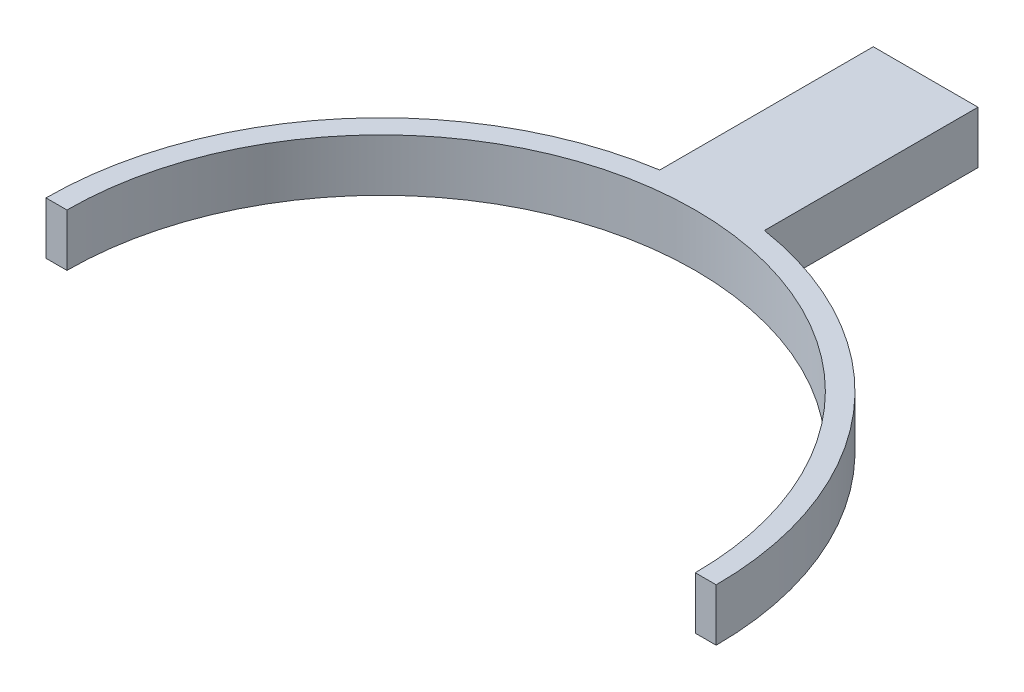
ISO-10303-21;
HEADER;
FILE_DESCRIPTION(('STEP AP214'),'2;1');
FILE_NAME('part.step','',(''),(''),'','','');
FILE_SCHEMA(('AUTOMOTIVE_DESIGN { 1 0 10303 214 1 1 1 1 }'));
ENDSEC;
DATA;
#1=APPLICATION_CONTEXT('core data for automotive mechanical design processes');
#2=APPLICATION_PROTOCOL_DEFINITION('international standard','automotive_design',2000,#1);
#3=PRODUCT_CONTEXT('',#1,'mechanical');
#4=PRODUCT('Part','Part','',(#3));
#5=PRODUCT_RELATED_PRODUCT_CATEGORY('part','',(#4));
#6=PRODUCT_DEFINITION_FORMATION('','',#4);
#7=PRODUCT_DEFINITION_CONTEXT('part definition',#1,'design');
#8=PRODUCT_DEFINITION('design','',#6,#7);
#9=PRODUCT_DEFINITION_SHAPE('','',#8);
#10=(LENGTH_UNIT() NAMED_UNIT(*) SI_UNIT(.MILLI.,.METRE.));
#11=(NAMED_UNIT(*) PLANE_ANGLE_UNIT() SI_UNIT($,.RADIAN.));
#12=(NAMED_UNIT(*) SI_UNIT($,.STERADIAN.) SOLID_ANGLE_UNIT());
#13=UNCERTAINTY_MEASURE_WITH_UNIT(LENGTH_MEASURE(1.E-05),#10,'distance_accuracy_value','');
#14=(GEOMETRIC_REPRESENTATION_CONTEXT(3) GLOBAL_UNCERTAINTY_ASSIGNED_CONTEXT((#13)) GLOBAL_UNIT_ASSIGNED_CONTEXT((#10,
#11,#12)) REPRESENTATION_CONTEXT('',''));
#15=CARTESIAN_POINT('',(0.,0.,0.));
#16=DIRECTION('',(0.,0.,1.));
#17=DIRECTION('',(1.,0.,0.));
#18=AXIS2_PLACEMENT_3D('',#15,#16,#17);
#19=CARTESIAN_POINT('',(0.,5.,0.));
#20=DIRECTION('',(0.,-1.,0.));
#21=DIRECTION('',(0.,0.,-1.));
#22=AXIS2_PLACEMENT_3D('',#19,#20,#21);
#23=CYLINDRICAL_SURFACE('',#22,32.);
#24=CARTESIAN_POINT('',(0.,0.,0.));
#25=DIRECTION('',(0.,1.,0.));
#26=DIRECTION('',(0.,0.,1.));
#27=AXIS2_PLACEMENT_3D('',#24,#25,#26);
#28=CIRCLE('',#27,32.);
#29=CARTESIAN_POINT('',(32.,0.,0.));
#30=VERTEX_POINT('',#29);
#31=CARTESIAN_POINT('',(5.,0.,-31.6069612585582));
#32=VERTEX_POINT('',#31);
#33=EDGE_CURVE('E148',#30,#32,#28,.T.);
#34=ORIENTED_EDGE('',*,*,#33,.T.);
#35=DIRECTION('',(0.,-1.,0.));
#36=VECTOR('',#35,1.);
#37=CARTESIAN_POINT('',(5.,5.,-31.6069612585582));
#38=LINE('',#37,#36);
#39=CARTESIAN_POINT('',(5.,5.,-31.6069612585582));
#40=VERTEX_POINT('',#39);
#41=EDGE_CURVE('E60',#32,#40,#38,.F.);
#42=ORIENTED_EDGE('',*,*,#41,.T.);
#43=CARTESIAN_POINT('',(0.,5.,0.));
#44=DIRECTION('',(0.,1.,0.));
#45=DIRECTION('',(0.,0.,1.));
#46=AXIS2_PLACEMENT_3D('',#43,#44,#45);
#47=CIRCLE('',#46,32.);
#48=CARTESIAN_POINT('',(32.,5.,0.));
#49=VERTEX_POINT('',#48);
#50=EDGE_CURVE('E122',#49,#40,#47,.T.);
#51=ORIENTED_EDGE('',*,*,#50,.F.);
#52=DIRECTION('',(0.,-1.,0.));
#53=VECTOR('',#52,1.);
#54=CARTESIAN_POINT('',(32.,5.,0.));
#55=LINE('',#54,#53);
#56=EDGE_CURVE('E147',#49,#30,#55,.T.);
#57=ORIENTED_EDGE('',*,*,#56,.T.);
#58=EDGE_LOOP('',(#34,#42,#51,#57));
#59=FACE_BOUND('',#58,.T.);
#60=ADVANCED_FACE('F37',(#59),#23,.T.);
#61=CARTESIAN_POINT('',(-5.,5.,-31.6069612585582));
#62=VERTEX_POINT('',#61);
#63=CARTESIAN_POINT('',(-32.,5.,0.));
#64=VERTEX_POINT('',#63);
#65=EDGE_CURVE('E52',#62,#64,#47,.T.);
#66=ORIENTED_EDGE('',*,*,#65,.F.);
#67=DIRECTION('',(0.,-1.,0.));
#68=VECTOR('',#67,1.);
#69=CARTESIAN_POINT('',(-5.,5.,-31.6069612585582));
#70=LINE('',#69,#68);
#71=CARTESIAN_POINT('',(-5.,0.,-31.6069612585582));
#72=VERTEX_POINT('',#71);
#73=EDGE_CURVE('E114',#62,#72,#70,.T.);
#74=ORIENTED_EDGE('',*,*,#73,.T.);
#75=CARTESIAN_POINT('',(-32.,0.,0.));
#76=VERTEX_POINT('',#75);
#77=EDGE_CURVE('E139',#72,#76,#28,.T.);
#78=ORIENTED_EDGE('',*,*,#77,.T.);
#79=DIRECTION('',(0.,-1.,0.));
#80=VECTOR('',#79,1.);
#81=CARTESIAN_POINT('',(-32.,5.,0.));
#82=LINE('',#81,#80);
#83=EDGE_CURVE('E11',#64,#76,#82,.T.);
#84=ORIENTED_EDGE('',*,*,#83,.F.);
#85=EDGE_LOOP('',(#66,#74,#78,#84));
#86=FACE_BOUND('',#85,.T.);
#87=ADVANCED_FACE('F39',(#86),#23,.T.);
#88=CARTESIAN_POINT('',(-32.,5.,0.));
#89=DIRECTION('',(0.,0.,-1.));
#90=DIRECTION('',(-1.,0.,0.));
#91=AXIS2_PLACEMENT_3D('',#88,#89,#90);
#92=PLANE('',#91);
#93=DIRECTION('',(1.,0.,0.));
#94=VECTOR('',#93,1.);
#95=CARTESIAN_POINT('',(-32.,0.,0.));
#96=LINE('',#95,#94);
#97=CARTESIAN_POINT('',(-30.,0.,0.));
#98=VERTEX_POINT('',#97);
#99=EDGE_CURVE('E150',#76,#98,#96,.T.);
#100=ORIENTED_EDGE('',*,*,#99,.T.);
#101=DIRECTION('',(0.,-1.,0.));
#102=VECTOR('',#101,1.);
#103=CARTESIAN_POINT('',(-30.,5.,0.));
#104=LINE('',#103,#102);
#105=CARTESIAN_POINT('',(-30.,5.,0.));
#106=VERTEX_POINT('',#105);
#107=EDGE_CURVE('E45',#106,#98,#104,.T.);
#108=ORIENTED_EDGE('',*,*,#107,.F.);
#109=DIRECTION('',(1.,0.,0.));
#110=VECTOR('',#109,1.);
#111=CARTESIAN_POINT('',(-32.,5.,0.));
#112=LINE('',#111,#110);
#113=EDGE_CURVE('E141',#64,#106,#112,.T.);
#114=ORIENTED_EDGE('',*,*,#113,.F.);
#115=ORIENTED_EDGE('',*,*,#83,.T.);
#116=EDGE_LOOP('',(#100,#108,#114,#115));
#117=FACE_BOUND('',#116,.T.);
#118=ADVANCED_FACE('F181',(#117),#92,.F.);
#119=CARTESIAN_POINT('',(0.,5.,0.));
#120=DIRECTION('',(0.,-1.,0.));
#121=DIRECTION('',(0.,0.,-1.));
#122=AXIS2_PLACEMENT_3D('',#119,#120,#121);
#123=CYLINDRICAL_SURFACE('',#122,30.);
#124=CARTESIAN_POINT('',(0.,0.,0.));
#125=DIRECTION('',(0.,-1.,0.));
#126=DIRECTION('',(0.,0.,1.));
#127=AXIS2_PLACEMENT_3D('',#124,#125,#126);
#128=CIRCLE('',#127,30.);
#129=CARTESIAN_POINT('',(30.,0.,0.));
#130=VERTEX_POINT('',#129);
#131=EDGE_CURVE('E152',#98,#130,#128,.T.);
#132=ORIENTED_EDGE('',*,*,#131,.T.);
#133=DIRECTION('',(0.,-1.,0.));
#134=VECTOR('',#133,1.);
#135=CARTESIAN_POINT('',(30.,5.,0.));
#136=LINE('',#135,#134);
#137=CARTESIAN_POINT('',(30.,5.,0.));
#138=VERTEX_POINT('',#137);
#139=EDGE_CURVE('E158',#138,#130,#136,.T.);
#140=ORIENTED_EDGE('',*,*,#139,.F.);
#141=CARTESIAN_POINT('',(0.,5.,0.));
#142=DIRECTION('',(0.,-1.,0.));
#143=DIRECTION('',(0.,0.,1.));
#144=AXIS2_PLACEMENT_3D('',#141,#142,#143);
#145=CIRCLE('',#144,30.);
#146=EDGE_CURVE('E143',#106,#138,#145,.T.);
#147=ORIENTED_EDGE('',*,*,#146,.F.);
#148=ORIENTED_EDGE('',*,*,#107,.T.);
#149=EDGE_LOOP('',(#132,#140,#147,#148));
#150=FACE_BOUND('',#149,.T.);
#151=ADVANCED_FACE('F165',(#150),#123,.F.);
#152=CARTESIAN_POINT('',(30.,5.,0.));
#153=DIRECTION('',(0.,0.,-1.));
#154=DIRECTION('',(-1.,0.,0.));
#155=AXIS2_PLACEMENT_3D('',#152,#153,#154);
#156=PLANE('',#155);
#157=DIRECTION('',(1.,0.,0.));
#158=VECTOR('',#157,1.);
#159=CARTESIAN_POINT('',(30.,0.,0.));
#160=LINE('',#159,#158);
#161=EDGE_CURVE('E154',#130,#30,#160,.T.);
#162=ORIENTED_EDGE('',*,*,#161,.T.);
#163=ORIENTED_EDGE('',*,*,#56,.F.);
#164=DIRECTION('',(1.,0.,0.));
#165=VECTOR('',#164,1.);
#166=CARTESIAN_POINT('',(30.,5.,0.));
#167=LINE('',#166,#165);
#168=EDGE_CURVE('E145',#138,#49,#167,.T.);
#169=ORIENTED_EDGE('',*,*,#168,.F.);
#170=ORIENTED_EDGE('',*,*,#139,.T.);
#171=EDGE_LOOP('',(#162,#163,#169,#170));
#172=FACE_BOUND('',#171,.T.);
#173=ADVANCED_FACE('F176',(#172),#156,.F.);
#174=CARTESIAN_POINT('',(0.,5.,0.));
#175=DIRECTION('',(0.,1.,0.));
#176=DIRECTION('',(0.,0.,1.));
#177=AXIS2_PLACEMENT_3D('',#174,#175,#176);
#178=PLANE('',#177);
#179=ORIENTED_EDGE('',*,*,#50,.T.);
#180=DIRECTION('',(0.,0.,1.));
#181=VECTOR('',#180,1.);
#182=CARTESIAN_POINT('',(5.,5.,0.));
#183=LINE('',#182,#181);
#184=CARTESIAN_POINT('',(5.,5.,-52.));
#185=VERTEX_POINT('',#184);
#186=EDGE_CURVE('E107',#185,#40,#183,.T.);
#187=ORIENTED_EDGE('',*,*,#186,.F.);
#188=DIRECTION('',(1.,0.,0.));
#189=VECTOR('',#188,1.);
#190=CARTESIAN_POINT('',(0.,5.,-52.));
#191=LINE('',#190,#189);
#192=CARTESIAN_POINT('',(-5.,5.,-52.));
#193=VERTEX_POINT('',#192);
#194=EDGE_CURVE('E121',#193,#185,#191,.T.);
#195=ORIENTED_EDGE('',*,*,#194,.F.);
#196=DIRECTION('',(0.,0.,-1.));
#197=VECTOR('',#196,1.);
#198=CARTESIAN_POINT('',(-5.,5.,0.));
#199=LINE('',#198,#197);
#200=EDGE_CURVE('E128',#62,#193,#199,.T.);
#201=ORIENTED_EDGE('',*,*,#200,.F.);
#202=ORIENTED_EDGE('',*,*,#65,.T.);
#203=ORIENTED_EDGE('',*,*,#113,.T.);
#204=ORIENTED_EDGE('',*,*,#146,.T.);
#205=ORIENTED_EDGE('',*,*,#168,.T.);
#206=EDGE_LOOP('',(#179,#187,#195,#201,#202,#203,#204,#205));
#207=FACE_BOUND('',#206,.T.);
#208=ADVANCED_FACE('F119',(#207),#178,.T.);
#209=CARTESIAN_POINT('',(0.,0.,0.));
#210=DIRECTION('',(0.,1.,0.));
#211=DIRECTION('',(0.,0.,1.));
#212=AXIS2_PLACEMENT_3D('',#209,#210,#211);
#213=PLANE('',#212);
#214=ORIENTED_EDGE('',*,*,#77,.F.);
#215=DIRECTION('',(0.,0.,-1.));
#216=VECTOR('',#215,1.);
#217=CARTESIAN_POINT('',(-5.,0.,0.));
#218=LINE('',#217,#216);
#219=CARTESIAN_POINT('',(-5.,0.,-52.));
#220=VERTEX_POINT('',#219);
#221=EDGE_CURVE('E123',#72,#220,#218,.T.);
#222=ORIENTED_EDGE('',*,*,#221,.T.);
#223=DIRECTION('',(1.,0.,0.));
#224=VECTOR('',#223,1.);
#225=CARTESIAN_POINT('',(0.,0.,-52.));
#226=LINE('',#225,#224);
#227=CARTESIAN_POINT('',(5.,0.,-52.));
#228=VERTEX_POINT('',#227);
#229=EDGE_CURVE('E133',#220,#228,#226,.T.);
#230=ORIENTED_EDGE('',*,*,#229,.T.);
#231=DIRECTION('',(0.,0.,1.));
#232=VECTOR('',#231,1.);
#233=CARTESIAN_POINT('',(5.,0.,0.));
#234=LINE('',#233,#232);
#235=EDGE_CURVE('E109',#228,#32,#234,.T.);
#236=ORIENTED_EDGE('',*,*,#235,.T.);
#237=ORIENTED_EDGE('',*,*,#33,.F.);
#238=ORIENTED_EDGE('',*,*,#161,.F.);
#239=ORIENTED_EDGE('',*,*,#131,.F.);
#240=ORIENTED_EDGE('',*,*,#99,.F.);
#241=EDGE_LOOP('',(#214,#222,#230,#236,#237,#238,#239,#240));
#242=FACE_BOUND('',#241,.T.);
#243=ADVANCED_FACE('F172',(#242),#213,.F.);
#244=CARTESIAN_POINT('',(5.,5.,0.));
#245=DIRECTION('',(1.,0.,0.));
#246=DIRECTION('',(0.,0.,-1.));
#247=AXIS2_PLACEMENT_3D('',#244,#245,#246);
#248=PLANE('',#247);
#249=ORIENTED_EDGE('',*,*,#41,.F.);
#250=ORIENTED_EDGE('',*,*,#235,.F.);
#251=DIRECTION('',(0.,-1.,0.));
#252=VECTOR('',#251,1.);
#253=CARTESIAN_POINT('',(5.,5.,-52.));
#254=LINE('',#253,#252);
#255=EDGE_CURVE('E104',#185,#228,#254,.T.);
#256=ORIENTED_EDGE('',*,*,#255,.F.);
#257=ORIENTED_EDGE('',*,*,#186,.T.);
#258=EDGE_LOOP('',(#249,#250,#256,#257));
#259=FACE_BOUND('',#258,.T.);
#260=ADVANCED_FACE('F106',(#259),#248,.T.);
#261=CARTESIAN_POINT('',(-5.,5.,0.));
#262=DIRECTION('',(-1.,0.,0.));
#263=DIRECTION('',(0.,0.,1.));
#264=AXIS2_PLACEMENT_3D('',#261,#262,#263);
#265=PLANE('',#264);
#266=ORIENTED_EDGE('',*,*,#73,.F.);
#267=ORIENTED_EDGE('',*,*,#200,.T.);
#268=DIRECTION('',(0.,-1.,0.));
#269=VECTOR('',#268,1.);
#270=CARTESIAN_POINT('',(-5.,5.,-52.));
#271=LINE('',#270,#269);
#272=EDGE_CURVE('E115',#193,#220,#271,.T.);
#273=ORIENTED_EDGE('',*,*,#272,.T.);
#274=ORIENTED_EDGE('',*,*,#221,.F.);
#275=EDGE_LOOP('',(#266,#267,#273,#274));
#276=FACE_BOUND('',#275,.T.);
#277=ADVANCED_FACE('F180',(#276),#265,.T.);
#278=CARTESIAN_POINT('',(0.,5.,-52.));
#279=DIRECTION('',(0.,0.,-1.));
#280=DIRECTION('',(-1.,0.,0.));
#281=AXIS2_PLACEMENT_3D('',#278,#279,#280);
#282=PLANE('',#281);
#283=ORIENTED_EDGE('',*,*,#229,.F.);
#284=ORIENTED_EDGE('',*,*,#272,.F.);
#285=ORIENTED_EDGE('',*,*,#194,.T.);
#286=ORIENTED_EDGE('',*,*,#255,.T.);
#287=EDGE_LOOP('',(#283,#284,#285,#286));
#288=FACE_BOUND('',#287,.T.);
#289=ADVANCED_FACE('F126',(#288),#282,.T.);
#290=CLOSED_SHELL('',(#60,#87,#118,#151,#173,#208,#243,#260,#277,#289));
#291=MANIFOLD_SOLID_BREP('B2',#290);
#292=ADVANCED_BREP_SHAPE_REPRESENTATION('',(#18,#291),#14);
#293=SHAPE_DEFINITION_REPRESENTATION(#9,#292);
ENDSEC;
END-ISO-10303-21;
